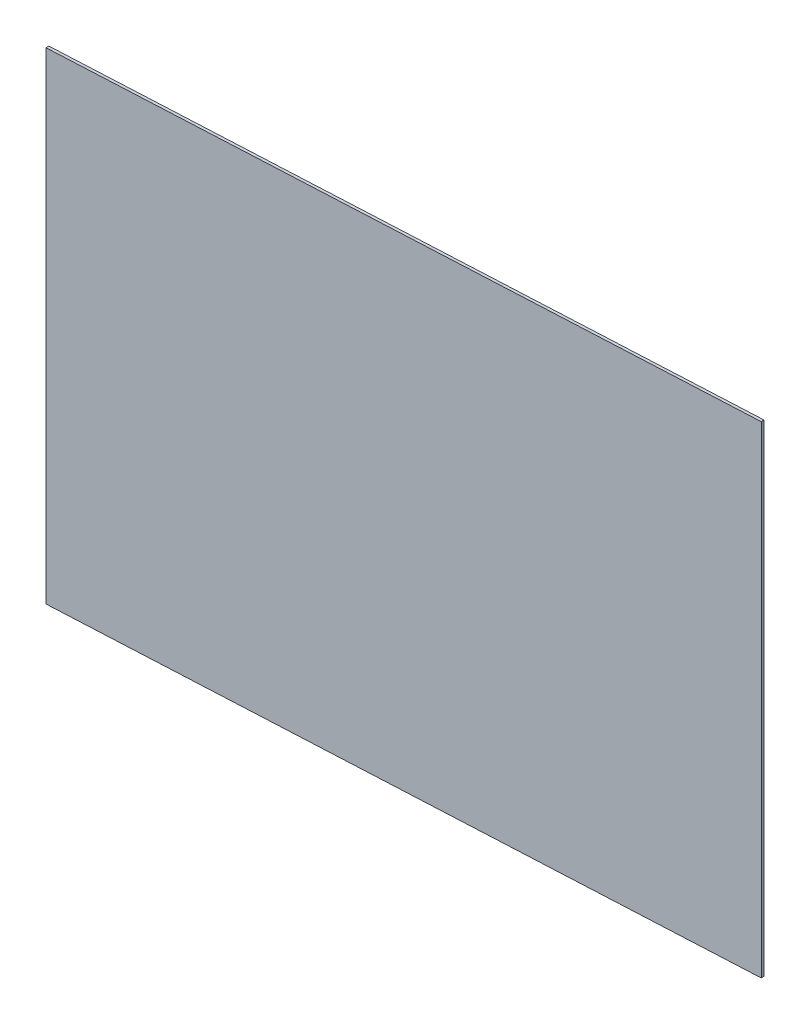
ISO-10303-21;
HEADER;
FILE_DESCRIPTION(('STEP AP214'),'2;1');
FILE_NAME('part.step','',(''),(''),'','','');
FILE_SCHEMA(('AUTOMOTIVE_DESIGN { 1 0 10303 214 1 1 1 1 }'));
ENDSEC;
DATA;
#1=APPLICATION_CONTEXT('core data for automotive mechanical design processes');
#2=APPLICATION_PROTOCOL_DEFINITION('international standard','automotive_design',2000,#1);
#3=PRODUCT_CONTEXT('',#1,'mechanical');
#4=PRODUCT('Part','Part','',(#3));
#5=PRODUCT_RELATED_PRODUCT_CATEGORY('part','',(#4));
#6=PRODUCT_DEFINITION_FORMATION('','',#4);
#7=PRODUCT_DEFINITION_CONTEXT('part definition',#1,'design');
#8=PRODUCT_DEFINITION('design','',#6,#7);
#9=PRODUCT_DEFINITION_SHAPE('','',#8);
#10=(LENGTH_UNIT() NAMED_UNIT(*) SI_UNIT(.MILLI.,.METRE.));
#11=(NAMED_UNIT(*) PLANE_ANGLE_UNIT() SI_UNIT($,.RADIAN.));
#12=(NAMED_UNIT(*) SI_UNIT($,.STERADIAN.) SOLID_ANGLE_UNIT());
#13=UNCERTAINTY_MEASURE_WITH_UNIT(LENGTH_MEASURE(1.E-05),#10,'distance_accuracy_value','');
#14=(GEOMETRIC_REPRESENTATION_CONTEXT(3) GLOBAL_UNCERTAINTY_ASSIGNED_CONTEXT((#13)) GLOBAL_UNIT_ASSIGNED_CONTEXT((#10,
#11,#12)) REPRESENTATION_CONTEXT('',''));
#15=CARTESIAN_POINT('',(0.,0.,0.));
#16=DIRECTION('',(0.,0.,1.));
#17=DIRECTION('',(1.,0.,0.));
#18=AXIS2_PLACEMENT_3D('',#15,#16,#17);
#19=CARTESIAN_POINT('',(-1345.24467948712,-195.25,115.892235482017));
#20=DIRECTION('',(0.,1.,0.));
#21=DIRECTION('',(0.,0.,1.));
#22=AXIS2_PLACEMENT_3D('',#19,#20,#21);
#23=PLANE('',#22);
#24=DIRECTION('',(0.998774283261394,0.,-0.0494967786395028));
#25=VECTOR('',#24,1.);
#26=CARTESIAN_POINT('',(-1345.35852207799,-195.25,113.595054630515));
#27=LINE('',#26,#25);
#28=CARTESIAN_POINT('',(-1345.35852207799,-195.25,113.595054630515));
#29=VERTEX_POINT('',#28);
#30=CARTESIAN_POINT('',(-793.03634343444,-195.25,86.2233360428703));
#31=VERTEX_POINT('',#30);
#32=EDGE_CURVE('E98',#29,#31,#27,.T.);
#33=ORIENTED_EDGE('',*,*,#32,.T.);
#34=DIRECTION('',(-0.0494967786395028,0.,-0.998774283261394));
#35=VECTOR('',#34,1.);
#36=CARTESIAN_POINT('',(-792.922500843569,-195.25,88.5205168943715));
#37=LINE('',#36,#35);
#38=CARTESIAN_POINT('',(-792.922500843569,-195.25,88.5205168943715));
#39=VERTEX_POINT('',#38);
#40=EDGE_CURVE('E11',#39,#31,#37,.T.);
#41=ORIENTED_EDGE('',*,*,#40,.F.);
#42=DIRECTION('',(0.998774283261394,0.,-0.0494967786395028));
#43=VECTOR('',#42,1.);
#44=CARTESIAN_POINT('',(-1345.24467948712,-195.25,115.892235482017));
#45=LINE('',#44,#43);
#46=CARTESIAN_POINT('',(-1345.24467948712,-195.25,115.892235482017));
#47=VERTEX_POINT('',#46);
#48=EDGE_CURVE('E75',#47,#39,#45,.T.);
#49=ORIENTED_EDGE('',*,*,#48,.F.);
#50=DIRECTION('',(-0.0494967786395028,0.,-0.998774283261394));
#51=VECTOR('',#50,1.);
#52=CARTESIAN_POINT('',(-1345.24467948712,-195.25,115.892235482017));
#53=LINE('',#52,#51);
#54=EDGE_CURVE('E94',#47,#29,#53,.T.);
#55=ORIENTED_EDGE('',*,*,#54,.T.);
#56=EDGE_LOOP('',(#33,#41,#49,#55));
#57=FACE_BOUND('',#56,.T.);
#58=ADVANCED_FACE('F36',(#57),#23,.F.);
#59=CARTESIAN_POINT('',(-792.922500843569,195.25,88.5205168943715));
#60=DIRECTION('',(0.998774283261394,0.,-0.0494967786395028));
#61=DIRECTION('',(-0.0494967786395028,0.,-0.998774283261394));
#62=AXIS2_PLACEMENT_3D('',#59,#60,#61);
#63=PLANE('',#62);
#64=DIRECTION('',(0.,-1.,0.));
#65=VECTOR('',#64,1.);
#66=CARTESIAN_POINT('',(-793.03634343444,195.25,86.2233360428703));
#67=LINE('',#66,#65);
#68=CARTESIAN_POINT('',(-793.03634343444,195.25,86.2233360428703));
#69=VERTEX_POINT('',#68);
#70=EDGE_CURVE('E84',#69,#31,#67,.T.);
#71=ORIENTED_EDGE('',*,*,#70,.F.);
#72=DIRECTION('',(-0.0494967786395028,0.,-0.998774283261394));
#73=VECTOR('',#72,1.);
#74=CARTESIAN_POINT('',(-792.922500843569,195.25,88.5205168943715));
#75=LINE('',#74,#73);
#76=CARTESIAN_POINT('',(-792.922500843569,195.25,88.5205168943715));
#77=VERTEX_POINT('',#76);
#78=EDGE_CURVE('E44',#77,#69,#75,.T.);
#79=ORIENTED_EDGE('',*,*,#78,.F.);
#80=DIRECTION('',(0.,-1.,0.));
#81=VECTOR('',#80,1.);
#82=CARTESIAN_POINT('',(-792.922500843569,195.25,88.5205168943715));
#83=LINE('',#82,#81);
#84=EDGE_CURVE('E82',#77,#39,#83,.T.);
#85=ORIENTED_EDGE('',*,*,#84,.T.);
#86=ORIENTED_EDGE('',*,*,#40,.T.);
#87=EDGE_LOOP('',(#71,#79,#85,#86));
#88=FACE_BOUND('',#87,.T.);
#89=ADVANCED_FACE('F81',(#88),#63,.T.);
#90=CARTESIAN_POINT('',(-1345.24467948712,195.25,115.892235482017));
#91=DIRECTION('',(0.,1.,0.));
#92=DIRECTION('',(0.,0.,1.));
#93=AXIS2_PLACEMENT_3D('',#90,#91,#92);
#94=PLANE('',#93);
#95=DIRECTION('',(0.998774283261394,0.,-0.0494967786395028));
#96=VECTOR('',#95,1.);
#97=CARTESIAN_POINT('',(-1345.35852207799,195.25,113.595054630515));
#98=LINE('',#97,#96);
#99=CARTESIAN_POINT('',(-1345.35852207799,195.25,113.595054630515));
#100=VERTEX_POINT('',#99);
#101=EDGE_CURVE('E102',#100,#69,#98,.T.);
#102=ORIENTED_EDGE('',*,*,#101,.F.);
#103=DIRECTION('',(-0.0494967786395028,0.,-0.998774283261394));
#104=VECTOR('',#103,1.);
#105=CARTESIAN_POINT('',(-1345.24467948712,195.25,115.892235482017));
#106=LINE('',#105,#104);
#107=CARTESIAN_POINT('',(-1345.24467948712,195.25,115.892235482017));
#108=VERTEX_POINT('',#107);
#109=EDGE_CURVE('E67',#108,#100,#106,.T.);
#110=ORIENTED_EDGE('',*,*,#109,.F.);
#111=DIRECTION('',(0.998774283261394,0.,-0.0494967786395028));
#112=VECTOR('',#111,1.);
#113=CARTESIAN_POINT('',(-1345.24467948712,195.25,115.892235482017));
#114=LINE('',#113,#112);
#115=EDGE_CURVE('E90',#108,#77,#114,.T.);
#116=ORIENTED_EDGE('',*,*,#115,.T.);
#117=ORIENTED_EDGE('',*,*,#78,.T.);
#118=EDGE_LOOP('',(#102,#110,#116,#117));
#119=FACE_BOUND('',#118,.T.);
#120=ADVANCED_FACE('F92',(#119),#94,.T.);
#121=CARTESIAN_POINT('',(-1345.24467948712,195.25,115.892235482017));
#122=DIRECTION('',(0.998774283261394,0.,-0.0494967786395028));
#123=DIRECTION('',(-0.0494967786395028,0.,-0.998774283261394));
#124=AXIS2_PLACEMENT_3D('',#121,#122,#123);
#125=PLANE('',#124);
#126=DIRECTION('',(0.,-1.,0.));
#127=VECTOR('',#126,1.);
#128=CARTESIAN_POINT('',(-1345.35852207799,195.25,113.595054630515));
#129=LINE('',#128,#127);
#130=EDGE_CURVE('E70',#100,#29,#129,.T.);
#131=ORIENTED_EDGE('',*,*,#130,.T.);
#132=ORIENTED_EDGE('',*,*,#54,.F.);
#133=DIRECTION('',(0.,-1.,0.));
#134=VECTOR('',#133,1.);
#135=CARTESIAN_POINT('',(-1345.24467948712,195.25,115.892235482017));
#136=LINE('',#135,#134);
#137=EDGE_CURVE('E52',#108,#47,#136,.T.);
#138=ORIENTED_EDGE('',*,*,#137,.F.);
#139=ORIENTED_EDGE('',*,*,#109,.T.);
#140=EDGE_LOOP('',(#131,#132,#138,#139));
#141=FACE_BOUND('',#140,.T.);
#142=ADVANCED_FACE('F115',(#141),#125,.F.);
#143=CARTESIAN_POINT('',(2.43350448458512,0.,49.1046440639497));
#144=DIRECTION('',(-0.0494967786395028,0.,-0.998774283261394));
#145=DIRECTION('',(-0.998774283261394,0.,0.0494967786395028));
#146=AXIS2_PLACEMENT_3D('',#143,#144,#145);
#147=PLANE('',#146);
#148=ORIENTED_EDGE('',*,*,#48,.T.);
#149=ORIENTED_EDGE('',*,*,#84,.F.);
#150=ORIENTED_EDGE('',*,*,#115,.F.);
#151=ORIENTED_EDGE('',*,*,#137,.T.);
#152=EDGE_LOOP('',(#148,#149,#150,#151));
#153=FACE_BOUND('',#152,.T.);
#154=ADVANCED_FACE('F89',(#153),#147,.F.);
#155=CARTESIAN_POINT('',(2.31966189371426,0.,46.8074632124485));
#156=DIRECTION('',(-0.0494967786395028,0.,-0.998774283261394));
#157=DIRECTION('',(-0.998774283261394,0.,0.0494967786395028));
#158=AXIS2_PLACEMENT_3D('',#155,#156,#157);
#159=PLANE('',#158);
#160=ORIENTED_EDGE('',*,*,#32,.F.);
#161=ORIENTED_EDGE('',*,*,#130,.F.);
#162=ORIENTED_EDGE('',*,*,#101,.T.);
#163=ORIENTED_EDGE('',*,*,#70,.T.);
#164=EDGE_LOOP('',(#160,#161,#162,#163));
#165=FACE_BOUND('',#164,.T.);
#166=ADVANCED_FACE('F109',(#165),#159,.T.);
#167=CLOSED_SHELL('',(#58,#89,#120,#142,#154,#166));
#168=MANIFOLD_SOLID_BREP('B2',#167);
#169=ADVANCED_BREP_SHAPE_REPRESENTATION('',(#18,#168),#14);
#170=SHAPE_DEFINITION_REPRESENTATION(#9,#169);
ENDSEC;
END-ISO-10303-21;
